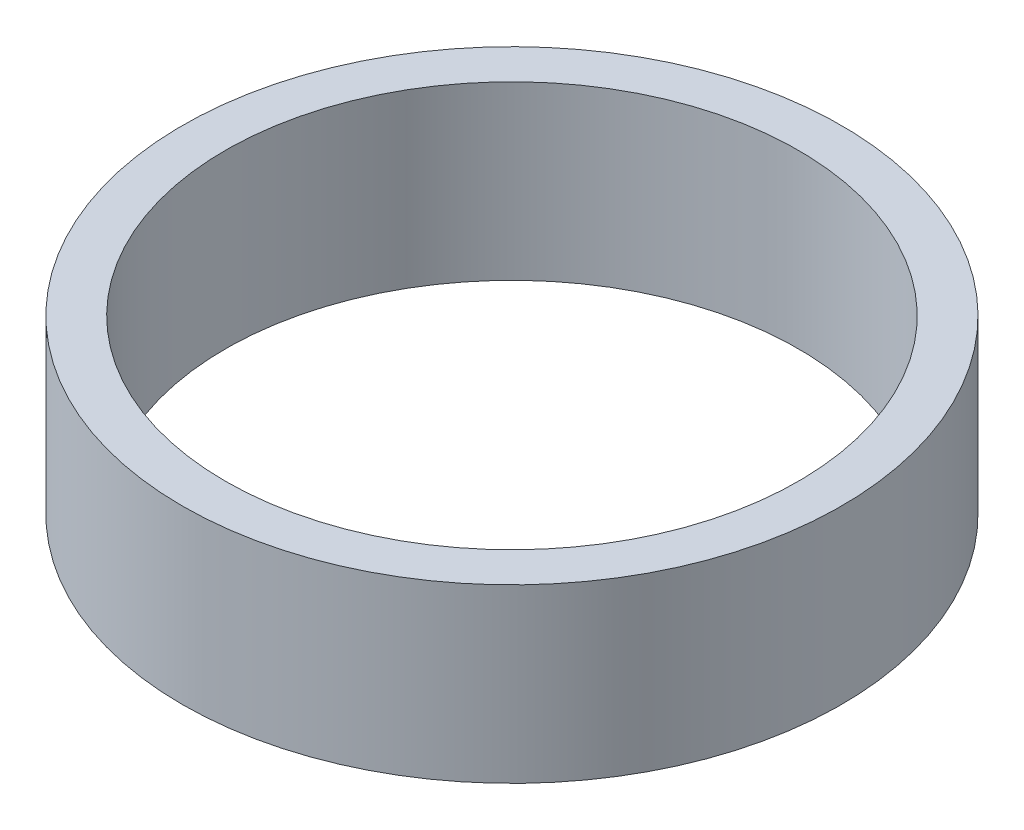
ISO-10303-21;
HEADER;
FILE_DESCRIPTION(('STEP AP214'),'2;1');
FILE_NAME('part.step','',(''),(''),'','','');
FILE_SCHEMA(('AUTOMOTIVE_DESIGN { 1 0 10303 214 1 1 1 1 }'));
ENDSEC;
DATA;
#1=APPLICATION_CONTEXT('core data for automotive mechanical design processes');
#2=APPLICATION_PROTOCOL_DEFINITION('international standard','automotive_design',2000,#1);
#3=PRODUCT_CONTEXT('',#1,'mechanical');
#4=PRODUCT('Part','Part','',(#3));
#5=PRODUCT_RELATED_PRODUCT_CATEGORY('part','',(#4));
#6=PRODUCT_DEFINITION_FORMATION('','',#4);
#7=PRODUCT_DEFINITION_CONTEXT('part definition',#1,'design');
#8=PRODUCT_DEFINITION('design','',#6,#7);
#9=PRODUCT_DEFINITION_SHAPE('','',#8);
#10=(LENGTH_UNIT() NAMED_UNIT(*) SI_UNIT(.MILLI.,.METRE.));
#11=(NAMED_UNIT(*) PLANE_ANGLE_UNIT() SI_UNIT($,.RADIAN.));
#12=(NAMED_UNIT(*) SI_UNIT($,.STERADIAN.) SOLID_ANGLE_UNIT());
#13=UNCERTAINTY_MEASURE_WITH_UNIT(LENGTH_MEASURE(1.E-05),#10,'distance_accuracy_value','');
#14=(GEOMETRIC_REPRESENTATION_CONTEXT(3) GLOBAL_UNCERTAINTY_ASSIGNED_CONTEXT((#13)) GLOBAL_UNIT_ASSIGNED_CONTEXT((#10,
#11,#12)) REPRESENTATION_CONTEXT('',''));
#15=CARTESIAN_POINT('',(0.,0.,0.));
#16=DIRECTION('',(0.,0.,1.));
#17=DIRECTION('',(1.,0.,0.));
#18=AXIS2_PLACEMENT_3D('',#15,#16,#17);
#19=CARTESIAN_POINT('',(0.,30.,0.));
#20=DIRECTION('',(0.,-1.,0.));
#21=DIRECTION('',(0.,0.,-1.));
#22=AXIS2_PLACEMENT_3D('',#19,#20,#21);
#23=CYLINDRICAL_SURFACE('',#22,57.5);
#24=CARTESIAN_POINT('',(0.,30.,0.));
#25=DIRECTION('',(0.,1.,0.));
#26=DIRECTION('',(0.,0.,1.));
#27=AXIS2_PLACEMENT_3D('',#24,#25,#26);
#28=CIRCLE('',#27,57.5);
#29=CARTESIAN_POINT('',(0.,30.,57.5));
#30=VERTEX_POINT('',#29);
#31=EDGE_CURVE('E10',#30,#30,#28,.T.);
#32=ORIENTED_EDGE('',*,*,#31,.F.);
#33=EDGE_LOOP('',(#32));
#34=FACE_BOUND('',#33,.T.);
#35=CARTESIAN_POINT('',(0.,0.,0.));
#36=DIRECTION('',(0.,1.,0.));
#37=DIRECTION('',(0.,0.,1.));
#38=AXIS2_PLACEMENT_3D('',#35,#36,#37);
#39=CIRCLE('',#38,57.5);
#40=CARTESIAN_POINT('',(0.,0.,57.5));
#41=VERTEX_POINT('',#40);
#42=EDGE_CURVE('E37',#41,#41,#39,.T.);
#43=ORIENTED_EDGE('',*,*,#42,.T.);
#44=EDGE_LOOP('',(#43));
#45=FACE_BOUND('',#44,.T.);
#46=ADVANCED_FACE('F40',(#34,#45),#23,.T.);
#47=CARTESIAN_POINT('',(0.,30.,0.));
#48=DIRECTION('',(0.,1.,0.));
#49=DIRECTION('',(0.,0.,1.));
#50=AXIS2_PLACEMENT_3D('',#47,#48,#49);
#51=PLANE('',#50);
#52=CARTESIAN_POINT('',(0.,30.,0.));
#53=DIRECTION('',(0.,1.,0.));
#54=DIRECTION('',(0.,0.,1.));
#55=AXIS2_PLACEMENT_3D('',#52,#53,#54);
#56=CIRCLE('',#55,50.);
#57=CARTESIAN_POINT('',(0.,30.,50.));
#58=VERTEX_POINT('',#57);
#59=EDGE_CURVE('E50',#58,#58,#56,.T.);
#60=ORIENTED_EDGE('',*,*,#59,.F.);
#61=EDGE_LOOP('',(#60));
#62=FACE_BOUND('',#61,.T.);
#63=ORIENTED_EDGE('',*,*,#31,.T.);
#64=EDGE_LOOP('',(#63));
#65=FACE_BOUND('',#64,.T.);
#66=ADVANCED_FACE('F59',(#62,#65),#51,.T.);
#67=CARTESIAN_POINT('',(0.,0.,0.));
#68=DIRECTION('',(0.,1.,0.));
#69=DIRECTION('',(0.,0.,1.));
#70=AXIS2_PLACEMENT_3D('',#67,#68,#69);
#71=PLANE('',#70);
#72=CARTESIAN_POINT('',(0.,0.,0.));
#73=DIRECTION('',(0.,1.,0.));
#74=DIRECTION('',(0.,0.,1.));
#75=AXIS2_PLACEMENT_3D('',#72,#73,#74);
#76=CIRCLE('',#75,50.);
#77=CARTESIAN_POINT('',(0.,0.,50.));
#78=VERTEX_POINT('',#77);
#79=EDGE_CURVE('E47',#78,#78,#76,.T.);
#80=ORIENTED_EDGE('',*,*,#79,.T.);
#81=EDGE_LOOP('',(#80));
#82=FACE_BOUND('',#81,.T.);
#83=ORIENTED_EDGE('',*,*,#42,.F.);
#84=EDGE_LOOP('',(#83));
#85=FACE_BOUND('',#84,.T.);
#86=ADVANCED_FACE('F58',(#82,#85),#71,.F.);
#87=CARTESIAN_POINT('',(0.,30.,0.));
#88=DIRECTION('',(0.,-1.,0.));
#89=DIRECTION('',(0.,0.,-1.));
#90=AXIS2_PLACEMENT_3D('',#87,#88,#89);
#91=CYLINDRICAL_SURFACE('',#90,50.);
#92=ORIENTED_EDGE('',*,*,#59,.T.);
#93=EDGE_LOOP('',(#92));
#94=FACE_BOUND('',#93,.T.);
#95=ORIENTED_EDGE('',*,*,#79,.F.);
#96=EDGE_LOOP('',(#95));
#97=FACE_BOUND('',#96,.T.);
#98=ADVANCED_FACE('F54',(#94,#97),#91,.F.);
#99=CLOSED_SHELL('',(#46,#66,#86,#98));
#100=MANIFOLD_SOLID_BREP('B2',#99);
#101=ADVANCED_BREP_SHAPE_REPRESENTATION('',(#18,#100),#14);
#102=SHAPE_DEFINITION_REPRESENTATION(#9,#101);
ENDSEC;
END-ISO-10303-21;
